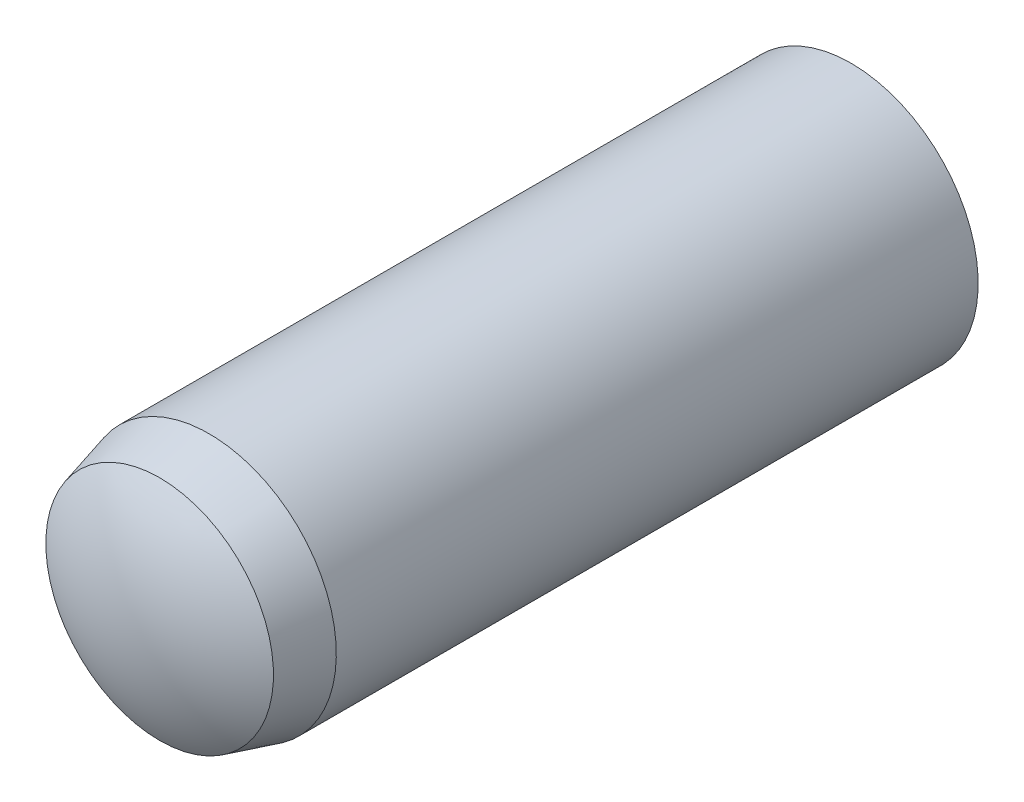
ISO-10303-21;
HEADER;
FILE_DESCRIPTION(('STEP AP214'),'2;1');
FILE_NAME('part.step','',(''),(''),'','','');
FILE_SCHEMA(('AUTOMOTIVE_DESIGN { 1 0 10303 214 1 1 1 1 }'));
ENDSEC;
DATA;
#1=APPLICATION_CONTEXT('core data for automotive mechanical design processes');
#2=APPLICATION_PROTOCOL_DEFINITION('international standard','automotive_design',2000,#1);
#3=PRODUCT_CONTEXT('',#1,'mechanical');
#4=PRODUCT('Part','Part','',(#3));
#5=PRODUCT_RELATED_PRODUCT_CATEGORY('part','',(#4));
#6=PRODUCT_DEFINITION_FORMATION('','',#4);
#7=PRODUCT_DEFINITION_CONTEXT('part definition',#1,'design');
#8=PRODUCT_DEFINITION('design','',#6,#7);
#9=PRODUCT_DEFINITION_SHAPE('','',#8);
#10=(LENGTH_UNIT() NAMED_UNIT(*) SI_UNIT(.MILLI.,.METRE.));
#11=(NAMED_UNIT(*) PLANE_ANGLE_UNIT() SI_UNIT($,.RADIAN.));
#12=(NAMED_UNIT(*) SI_UNIT($,.STERADIAN.) SOLID_ANGLE_UNIT());
#13=UNCERTAINTY_MEASURE_WITH_UNIT(LENGTH_MEASURE(1.E-05),#10,'distance_accuracy_value','');
#14=(GEOMETRIC_REPRESENTATION_CONTEXT(3) GLOBAL_UNCERTAINTY_ASSIGNED_CONTEXT((#13)) GLOBAL_UNIT_ASSIGNED_CONTEXT((#10,
#11,#12)) REPRESENTATION_CONTEXT('',''));
#15=CARTESIAN_POINT('',(0.,0.,0.));
#16=DIRECTION('',(0.,0.,1.));
#17=DIRECTION('',(1.,0.,0.));
#18=AXIS2_PLACEMENT_3D('',#15,#16,#17);
#19=CARTESIAN_POINT('',(0.,0.,-2.36666666666665));
#20=DIRECTION('',(0.,0.,1.));
#21=DIRECTION('',(0.,1.,0.));
#22=AXIS2_PLACEMENT_3D('',#19,#20,#21);
#23=SPHERICAL_SURFACE('',#22,3.63333333333335);
#24=CARTESIAN_POINT('',(0.,0.,-5.4));
#25=DIRECTION('',(0.,0.,1.));
#26=DIRECTION('',(0.,-1.,0.));
#27=AXIS2_PLACEMENT_3D('',#24,#25,#26);
#28=CIRCLE('',#27,2.);
#29=CARTESIAN_POINT('',(0.,-2.,-5.4));
#30=VERTEX_POINT('',#29);
#31=EDGE_CURVE('E10',#30,#30,#28,.T.);
#32=ORIENTED_EDGE('',*,*,#31,.F.);
#33=EDGE_LOOP('',(#32));
#34=FACE_BOUND('',#33,.T.);
#35=ADVANCED_FACE('F41',(#34),#23,.T.);
#36=CARTESIAN_POINT('',(0.,0.,6.));
#37=DIRECTION('',(0.,0.,1.));
#38=DIRECTION('',(0.,-1.,0.));
#39=AXIS2_PLACEMENT_3D('',#36,#37,#38);
#40=CYLINDRICAL_SURFACE('',#39,2.);
#41=CARTESIAN_POINT('',(0.,0.,4.7));
#42=DIRECTION('',(0.,0.,1.));
#43=DIRECTION('',(0.,-1.,0.));
#44=AXIS2_PLACEMENT_3D('',#41,#42,#43);
#45=CIRCLE('',#44,2.);
#46=CARTESIAN_POINT('',(0.,-2.,4.7));
#47=VERTEX_POINT('',#46);
#48=EDGE_CURVE('E48',#47,#47,#45,.T.);
#49=ORIENTED_EDGE('',*,*,#48,.F.);
#50=EDGE_LOOP('',(#49));
#51=FACE_BOUND('',#50,.T.);
#52=ORIENTED_EDGE('',*,*,#31,.T.);
#53=EDGE_LOOP('',(#52));
#54=FACE_BOUND('',#53,.T.);
#55=ADVANCED_FACE('F65',(#51,#54),#40,.T.);
#56=CARTESIAN_POINT('',(0.,0.,4.7));
#57=DIRECTION('',(0.,0.,-1.));
#58=DIRECTION('',(0.,1.,0.));
#59=AXIS2_PLACEMENT_3D('',#56,#57,#58);
#60=CONICAL_SURFACE('',#59,2.,0.26179938779915);
#61=CARTESIAN_POINT('',(0.,0.,5.48));
#62=DIRECTION('',(0.,0.,1.));
#63=DIRECTION('',(0.,-1.,0.));
#64=AXIS2_PLACEMENT_3D('',#61,#62,#63);
#65=CIRCLE('',#64,1.79099962990372);
#66=CARTESIAN_POINT('',(0.,-1.79099962990372,5.48));
#67=VERTEX_POINT('',#66);
#68=EDGE_CURVE('E53',#67,#67,#65,.T.);
#69=ORIENTED_EDGE('',*,*,#68,.F.);
#70=EDGE_LOOP('',(#69));
#71=FACE_BOUND('',#70,.T.);
#72=ORIENTED_EDGE('',*,*,#48,.T.);
#73=EDGE_LOOP('',(#72));
#74=FACE_BOUND('',#73,.T.);
#75=ADVANCED_FACE('F63',(#71,#74),#60,.T.);
#76=CARTESIAN_POINT('',(0.,0.,2.65569262085069));
#77=DIRECTION('',(0.,0.,1.));
#78=DIRECTION('',(0.,1.,0.));
#79=AXIS2_PLACEMENT_3D('',#76,#77,#78);
#80=SPHERICAL_SURFACE('',#79,3.3443073791493);
#81=ORIENTED_EDGE('',*,*,#68,.T.);
#82=EDGE_LOOP('',(#81));
#83=FACE_BOUND('',#82,.T.);
#84=ADVANCED_FACE('F61',(#83),#80,.T.);
#85=CLOSED_SHELL('',(#35,#55,#75,#84));
#86=MANIFOLD_SOLID_BREP('B2',#85);
#87=ADVANCED_BREP_SHAPE_REPRESENTATION('',(#18,#86),#14);
#88=SHAPE_DEFINITION_REPRESENTATION(#9,#87);
ENDSEC;
END-ISO-10303-21;
